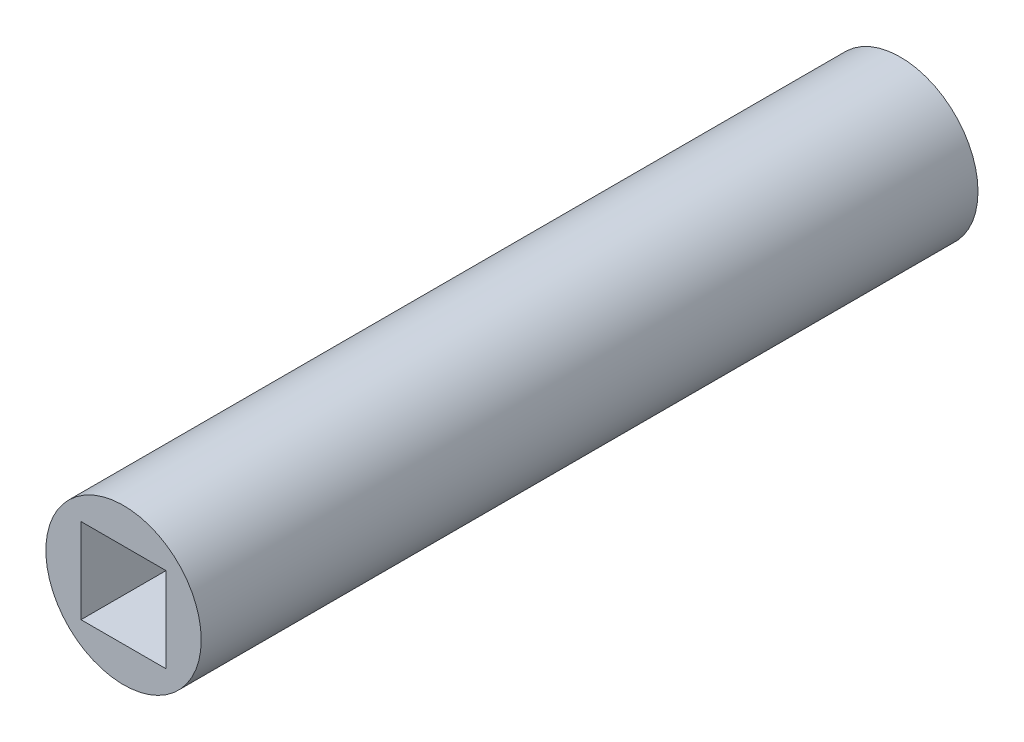
ISO-10303-21;
HEADER;
FILE_DESCRIPTION(('STEP AP214'),'2;1');
FILE_NAME('part.step','',(''),(''),'','','');
FILE_SCHEMA(('AUTOMOTIVE_DESIGN { 1 0 10303 214 1 1 1 1 }'));
ENDSEC;
DATA;
#1=APPLICATION_CONTEXT('core data for automotive mechanical design processes');
#2=APPLICATION_PROTOCOL_DEFINITION('international standard','automotive_design',2000,#1);
#3=PRODUCT_CONTEXT('',#1,'mechanical');
#4=PRODUCT('Part','Part','',(#3));
#5=PRODUCT_RELATED_PRODUCT_CATEGORY('part','',(#4));
#6=PRODUCT_DEFINITION_FORMATION('','',#4);
#7=PRODUCT_DEFINITION_CONTEXT('part definition',#1,'design');
#8=PRODUCT_DEFINITION('design','',#6,#7);
#9=PRODUCT_DEFINITION_SHAPE('','',#8);
#10=(LENGTH_UNIT() NAMED_UNIT(*) SI_UNIT(.MILLI.,.METRE.));
#11=(NAMED_UNIT(*) PLANE_ANGLE_UNIT() SI_UNIT($,.RADIAN.));
#12=(NAMED_UNIT(*) SI_UNIT($,.STERADIAN.) SOLID_ANGLE_UNIT());
#13=UNCERTAINTY_MEASURE_WITH_UNIT(LENGTH_MEASURE(1.E-05),#10,'distance_accuracy_value','');
#14=(GEOMETRIC_REPRESENTATION_CONTEXT(3) GLOBAL_UNCERTAINTY_ASSIGNED_CONTEXT((#13)) GLOBAL_UNIT_ASSIGNED_CONTEXT((#10,
#11,#12)) REPRESENTATION_CONTEXT('',''));
#15=CARTESIAN_POINT('',(0.,0.,0.));
#16=DIRECTION('',(0.,0.,1.));
#17=DIRECTION('',(1.,0.,0.));
#18=AXIS2_PLACEMENT_3D('',#15,#16,#17);
#19=CARTESIAN_POINT('',(0.,0.,31.75));
#20=DIRECTION('',(0.,0.,1.));
#21=DIRECTION('',(1.,0.,0.));
#22=AXIS2_PLACEMENT_3D('',#19,#20,#21);
#23=PLANE('',#22);
#24=CARTESIAN_POINT('',(0.,0.,31.75));
#25=DIRECTION('',(0.,0.,1.));
#26=DIRECTION('',(1.,0.,0.));
#27=AXIS2_PLACEMENT_3D('',#24,#25,#26);
#28=CIRCLE('',#27,3.175);
#29=CARTESIAN_POINT('',(3.175,0.,31.75));
#30=VERTEX_POINT('',#29);
#31=EDGE_CURVE('E11',#30,#30,#28,.T.);
#32=ORIENTED_EDGE('',*,*,#31,.T.);
#33=EDGE_LOOP('',(#32));
#34=FACE_BOUND('',#33,.T.);
#35=DIRECTION('',(-1.,0.,0.));
#36=VECTOR('',#35,1.);
#37=CARTESIAN_POINT('',(-1.7375,1.7375,31.75));
#38=LINE('',#37,#36);
#39=CARTESIAN_POINT('',(1.7375,1.7375,31.75));
#40=VERTEX_POINT('',#39);
#41=CARTESIAN_POINT('',(-1.7375,1.7375,31.75));
#42=VERTEX_POINT('',#41);
#43=EDGE_CURVE('E82',#40,#42,#38,.T.);
#44=ORIENTED_EDGE('',*,*,#43,.F.);
#45=DIRECTION('',(0.,1.,0.));
#46=VECTOR('',#45,1.);
#47=CARTESIAN_POINT('',(1.7375,-1.7375,31.75));
#48=LINE('',#47,#46);
#49=CARTESIAN_POINT('',(1.7375,-1.7375,31.75));
#50=VERTEX_POINT('',#49);
#51=EDGE_CURVE('E74',#50,#40,#48,.T.);
#52=ORIENTED_EDGE('',*,*,#51,.F.);
#53=DIRECTION('',(1.,0.,0.));
#54=VECTOR('',#53,1.);
#55=CARTESIAN_POINT('',(-1.7375,-1.7375,31.75));
#56=LINE('',#55,#54);
#57=CARTESIAN_POINT('',(-1.7375,-1.7375,31.75));
#58=VERTEX_POINT('',#57);
#59=EDGE_CURVE('E95',#58,#50,#56,.T.);
#60=ORIENTED_EDGE('',*,*,#59,.F.);
#61=DIRECTION('',(0.,-1.,0.));
#62=VECTOR('',#61,1.);
#63=CARTESIAN_POINT('',(-1.7375,-1.7375,31.75));
#64=LINE('',#63,#62);
#65=EDGE_CURVE('E93',#42,#58,#64,.T.);
#66=ORIENTED_EDGE('',*,*,#65,.F.);
#67=EDGE_LOOP('',(#44,#52,#60,#66));
#68=FACE_BOUND('',#67,.T.);
#69=ADVANCED_FACE('F33',(#34,#68),#23,.T.);
#70=CARTESIAN_POINT('',(0.,0.,0.));
#71=DIRECTION('',(0.,0.,1.));
#72=DIRECTION('',(1.,0.,0.));
#73=AXIS2_PLACEMENT_3D('',#70,#71,#72);
#74=PLANE('',#73);
#75=CARTESIAN_POINT('',(0.,0.,0.));
#76=DIRECTION('',(0.,0.,1.));
#77=DIRECTION('',(1.,0.,0.));
#78=AXIS2_PLACEMENT_3D('',#75,#76,#77);
#79=CIRCLE('',#78,3.175);
#80=CARTESIAN_POINT('',(3.175,0.,0.));
#81=VERTEX_POINT('',#80);
#82=EDGE_CURVE('E37',#81,#81,#79,.T.);
#83=ORIENTED_EDGE('',*,*,#82,.F.);
#84=EDGE_LOOP('',(#83));
#85=FACE_BOUND('',#84,.T.);
#86=DIRECTION('',(0.,1.,0.));
#87=VECTOR('',#86,1.);
#88=CARTESIAN_POINT('',(1.7375,-1.7375,0.));
#89=LINE('',#88,#87);
#90=CARTESIAN_POINT('',(1.7375,-1.7375,0.));
#91=VERTEX_POINT('',#90);
#92=CARTESIAN_POINT('',(1.7375,1.7375,0.));
#93=VERTEX_POINT('',#92);
#94=EDGE_CURVE('E56',#91,#93,#89,.T.);
#95=ORIENTED_EDGE('',*,*,#94,.T.);
#96=DIRECTION('',(-1.,0.,0.));
#97=VECTOR('',#96,1.);
#98=CARTESIAN_POINT('',(-1.7375,1.7375,0.));
#99=LINE('',#98,#97);
#100=CARTESIAN_POINT('',(-1.7375,1.7375,0.));
#101=VERTEX_POINT('',#100);
#102=EDGE_CURVE('E89',#93,#101,#99,.T.);
#103=ORIENTED_EDGE('',*,*,#102,.T.);
#104=DIRECTION('',(0.,-1.,0.));
#105=VECTOR('',#104,1.);
#106=CARTESIAN_POINT('',(-1.7375,-1.7375,0.));
#107=LINE('',#106,#105);
#108=CARTESIAN_POINT('',(-1.7375,-1.7375,0.));
#109=VERTEX_POINT('',#108);
#110=EDGE_CURVE('E101',#101,#109,#107,.T.);
#111=ORIENTED_EDGE('',*,*,#110,.T.);
#112=DIRECTION('',(1.,0.,0.));
#113=VECTOR('',#112,1.);
#114=CARTESIAN_POINT('',(-1.7375,-1.7375,0.));
#115=LINE('',#114,#113);
#116=EDGE_CURVE('E83',#109,#91,#115,.T.);
#117=ORIENTED_EDGE('',*,*,#116,.T.);
#118=EDGE_LOOP('',(#95,#103,#111,#117));
#119=FACE_BOUND('',#118,.T.);
#120=ADVANCED_FACE('F112',(#85,#119),#74,.F.);
#121=CARTESIAN_POINT('',(0.,0.,31.75));
#122=DIRECTION('',(0.,0.,-1.));
#123=DIRECTION('',(-1.,0.,0.));
#124=AXIS2_PLACEMENT_3D('',#121,#122,#123);
#125=CYLINDRICAL_SURFACE('',#124,3.175);
#126=ORIENTED_EDGE('',*,*,#31,.F.);
#127=EDGE_LOOP('',(#126));
#128=FACE_BOUND('',#127,.T.);
#129=ORIENTED_EDGE('',*,*,#82,.T.);
#130=EDGE_LOOP('',(#129));
#131=FACE_BOUND('',#130,.T.);
#132=ADVANCED_FACE('F35',(#128,#131),#125,.T.);
#133=CARTESIAN_POINT('',(1.7375,-1.7375,31.75));
#134=DIRECTION('',(-1.,0.,0.));
#135=DIRECTION('',(0.,0.,1.));
#136=AXIS2_PLACEMENT_3D('',#133,#134,#135);
#137=PLANE('',#136);
#138=ORIENTED_EDGE('',*,*,#94,.F.);
#139=DIRECTION('',(0.,0.,-1.));
#140=VECTOR('',#139,1.);
#141=CARTESIAN_POINT('',(1.7375,-1.7375,31.75));
#142=LINE('',#141,#140);
#143=EDGE_CURVE('E78',#50,#91,#142,.T.);
#144=ORIENTED_EDGE('',*,*,#143,.F.);
#145=ORIENTED_EDGE('',*,*,#51,.T.);
#146=DIRECTION('',(0.,0.,-1.));
#147=VECTOR('',#146,1.);
#148=CARTESIAN_POINT('',(1.7375,1.7375,31.75));
#149=LINE('',#148,#147);
#150=EDGE_CURVE('E77',#40,#93,#149,.T.);
#151=ORIENTED_EDGE('',*,*,#150,.T.);
#152=EDGE_LOOP('',(#138,#144,#145,#151));
#153=FACE_BOUND('',#152,.T.);
#154=ADVANCED_FACE('F76',(#153),#137,.T.);
#155=CARTESIAN_POINT('',(-1.7375,1.7375,31.75));
#156=DIRECTION('',(0.,-1.,0.));
#157=DIRECTION('',(0.,0.,-1.));
#158=AXIS2_PLACEMENT_3D('',#155,#156,#157);
#159=PLANE('',#158);
#160=ORIENTED_EDGE('',*,*,#102,.F.);
#161=ORIENTED_EDGE('',*,*,#150,.F.);
#162=ORIENTED_EDGE('',*,*,#43,.T.);
#163=DIRECTION('',(0.,0.,-1.));
#164=VECTOR('',#163,1.);
#165=CARTESIAN_POINT('',(-1.7375,1.7375,31.75));
#166=LINE('',#165,#164);
#167=EDGE_CURVE('E90',#42,#101,#166,.T.);
#168=ORIENTED_EDGE('',*,*,#167,.T.);
#169=EDGE_LOOP('',(#160,#161,#162,#168));
#170=FACE_BOUND('',#169,.T.);
#171=ADVANCED_FACE('F86',(#170),#159,.T.);
#172=CARTESIAN_POINT('',(-1.7375,-1.7375,31.75));
#173=DIRECTION('',(1.,0.,0.));
#174=DIRECTION('',(0.,0.,-1.));
#175=AXIS2_PLACEMENT_3D('',#172,#173,#174);
#176=PLANE('',#175);
#177=ORIENTED_EDGE('',*,*,#110,.F.);
#178=ORIENTED_EDGE('',*,*,#167,.F.);
#179=ORIENTED_EDGE('',*,*,#65,.T.);
#180=DIRECTION('',(0.,0.,-1.));
#181=VECTOR('',#180,1.);
#182=CARTESIAN_POINT('',(-1.7375,-1.7375,31.75));
#183=LINE('',#182,#181);
#184=EDGE_CURVE('E48',#58,#109,#183,.T.);
#185=ORIENTED_EDGE('',*,*,#184,.T.);
#186=EDGE_LOOP('',(#177,#178,#179,#185));
#187=FACE_BOUND('',#186,.T.);
#188=ADVANCED_FACE('F110',(#187),#176,.T.);
#189=CARTESIAN_POINT('',(-1.7375,-1.7375,31.75));
#190=DIRECTION('',(0.,1.,0.));
#191=DIRECTION('',(0.,0.,1.));
#192=AXIS2_PLACEMENT_3D('',#189,#190,#191);
#193=PLANE('',#192);
#194=ORIENTED_EDGE('',*,*,#116,.F.);
#195=ORIENTED_EDGE('',*,*,#184,.F.);
#196=ORIENTED_EDGE('',*,*,#59,.T.);
#197=ORIENTED_EDGE('',*,*,#143,.T.);
#198=EDGE_LOOP('',(#194,#195,#196,#197));
#199=FACE_BOUND('',#198,.T.);
#200=ADVANCED_FACE('F113',(#199),#193,.T.);
#201=CLOSED_SHELL('',(#69,#120,#132,#154,#171,#188,#200));
#202=MANIFOLD_SOLID_BREP('B2',#201);
#203=ADVANCED_BREP_SHAPE_REPRESENTATION('',(#18,#202),#14);
#204=SHAPE_DEFINITION_REPRESENTATION(#9,#203);
ENDSEC;
END-ISO-10303-21;
